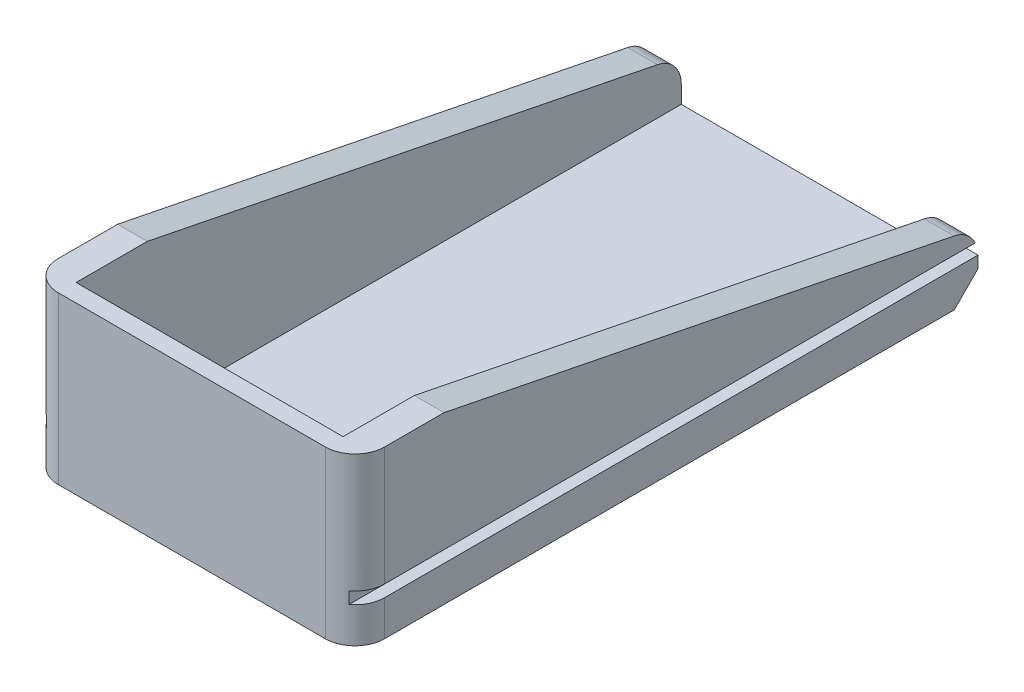
ISO-10303-21;
HEADER;
FILE_DESCRIPTION(('STEP AP214'),'2;1');
FILE_NAME('part.step','',(''),(''),'','','');
FILE_SCHEMA(('AUTOMOTIVE_DESIGN { 1 0 10303 214 1 1 1 1 }'));
ENDSEC;
DATA;
#1=APPLICATION_CONTEXT('core data for automotive mechanical design processes');
#2=APPLICATION_PROTOCOL_DEFINITION('international standard','automotive_design',2000,#1);
#3=PRODUCT_CONTEXT('',#1,'mechanical');
#4=PRODUCT('Part','Part','',(#3));
#5=PRODUCT_RELATED_PRODUCT_CATEGORY('part','',(#4));
#6=PRODUCT_DEFINITION_FORMATION('','',#4);
#7=PRODUCT_DEFINITION_CONTEXT('part definition',#1,'design');
#8=PRODUCT_DEFINITION('design','',#6,#7);
#9=PRODUCT_DEFINITION_SHAPE('','',#8);
#10=(LENGTH_UNIT() NAMED_UNIT(*) SI_UNIT(.MILLI.,.METRE.));
#11=(NAMED_UNIT(*) PLANE_ANGLE_UNIT() SI_UNIT($,.RADIAN.));
#12=(NAMED_UNIT(*) SI_UNIT($,.STERADIAN.) SOLID_ANGLE_UNIT());
#13=UNCERTAINTY_MEASURE_WITH_UNIT(LENGTH_MEASURE(1.E-05),#10,'distance_accuracy_value','');
#14=(GEOMETRIC_REPRESENTATION_CONTEXT(3) GLOBAL_UNCERTAINTY_ASSIGNED_CONTEXT((#13)) GLOBAL_UNIT_ASSIGNED_CONTEXT((#10,
#11,#12)) REPRESENTATION_CONTEXT('',''));
#15=CARTESIAN_POINT('',(0.,0.,0.));
#16=DIRECTION('',(0.,0.,1.));
#17=DIRECTION('',(1.,0.,0.));
#18=AXIS2_PLACEMENT_3D('',#15,#16,#17);
#19=CARTESIAN_POINT('',(-27.5,-3.,52.5));
#20=DIRECTION('',(-1.,0.,0.));
#21=DIRECTION('',(0.,0.,1.));
#22=AXIS2_PLACEMENT_3D('',#19,#20,#21);
#23=PLANE('',#22);
#24=DIRECTION('',(0.,1.,0.));
#25=VECTOR('',#24,1.);
#26=CARTESIAN_POINT('',(-27.5,-3.,-52.5));
#27=LINE('',#26,#25);
#28=CARTESIAN_POINT('',(-27.5,0.999999999999994,-52.5));
#29=VERTEX_POINT('',#28);
#30=CARTESIAN_POINT('',(-27.5,2.90098048640722,-52.5));
#31=VERTEX_POINT('',#30);
#32=EDGE_CURVE('E209',#29,#31,#27,.T.);
#33=ORIENTED_EDGE('',*,*,#32,.F.);
#34=DIRECTION('',(0.,-0.707106781186548,0.707106781186547));
#35=VECTOR('',#34,1.);
#36=CARTESIAN_POINT('',(-27.5,-53.5,1.99999999999993));
#37=LINE('',#36,#35);
#38=CARTESIAN_POINT('',(-27.5,-3.,-48.5));
#39=VERTEX_POINT('',#38);
#40=EDGE_CURVE('E11',#29,#39,#37,.T.);
#41=ORIENTED_EDGE('',*,*,#40,.T.);
#42=DIRECTION('',(0.,0.,1.));
#43=VECTOR('',#42,1.);
#44=CARTESIAN_POINT('',(-27.5,-3.,52.5));
#45=LINE('',#44,#43);
#46=CARTESIAN_POINT('',(-27.5,-3.,47.5));
#47=VERTEX_POINT('',#46);
#48=EDGE_CURVE('E345',#39,#47,#45,.T.);
#49=ORIENTED_EDGE('',*,*,#48,.T.);
#50=DIRECTION('',(0.,1.,0.));
#51=VECTOR('',#50,1.);
#52=CARTESIAN_POINT('',(-27.5,-3.,47.5));
#53=LINE('',#52,#51);
#54=CARTESIAN_POINT('',(-27.5,3.,47.5));
#55=VERTEX_POINT('',#54);
#56=EDGE_CURVE('E283',#47,#55,#53,.T.);
#57=ORIENTED_EDGE('',*,*,#56,.T.);
#58=DIRECTION('',(0.,0.,-1.));
#59=VECTOR('',#58,1.);
#60=CARTESIAN_POINT('',(-27.5,3.,52.5));
#61=LINE('',#60,#59);
#62=CARTESIAN_POINT('',(-27.5,3.,-52.4990194174386));
#63=VERTEX_POINT('',#62);
#64=EDGE_CURVE('E441',#55,#63,#61,.T.);
#65=ORIENTED_EDGE('',*,*,#64,.T.);
#66=CARTESIAN_POINT('',(-27.5,2.90098048640722,-47.5));
#67=DIRECTION('',(-1.,0.,0.));
#68=DIRECTION('',(0.,0.,1.));
#69=AXIS2_PLACEMENT_3D('',#66,#67,#68);
#70=CIRCLE('',#69,5.);
#71=EDGE_CURVE('E216',#63,#31,#70,.T.);
#72=ORIENTED_EDGE('',*,*,#71,.T.);
#73=EDGE_LOOP('',(#33,#41,#49,#57,#65,#72));
#74=FACE_BOUND('',#73,.T.);
#75=ADVANCED_FACE('F42',(#74),#23,.T.);
#76=CARTESIAN_POINT('',(-27.5,-3.,-52.5));
#77=DIRECTION('',(0.,0.,-1.));
#78=DIRECTION('',(-1.,0.,0.));
#79=AXIS2_PLACEMENT_3D('',#76,#77,#78);
#80=PLANE('',#79);
#81=DIRECTION('',(-1.,0.,0.));
#82=VECTOR('',#81,1.);
#83=CARTESIAN_POINT('',(-27.5,-3.,-52.5));
#84=LINE('',#83,#82);
#85=CARTESIAN_POINT('',(23.5,-3.,-52.5));
#86=VERTEX_POINT('',#85);
#87=CARTESIAN_POINT('',(-23.5,-3.,-52.5));
#88=VERTEX_POINT('',#87);
#89=EDGE_CURVE('E213',#86,#88,#84,.T.);
#90=ORIENTED_EDGE('',*,*,#89,.T.);
#91=DIRECTION('',(-0.707106781186548,0.707106781186547,0.));
#92=VECTOR('',#91,1.);
#93=CARTESIAN_POINT('',(-25.5,-1.00000000000001,-52.5));
#94=LINE('',#93,#92);
#95=EDGE_CURVE('E51',#88,#29,#94,.T.);
#96=ORIENTED_EDGE('',*,*,#95,.T.);
#97=ORIENTED_EDGE('',*,*,#32,.T.);
#98=DIRECTION('',(1.,0.,0.));
#99=VECTOR('',#98,1.);
#100=CARTESIAN_POINT('',(-22.5,2.90098048640722,-52.5));
#101=LINE('',#100,#99);
#102=CARTESIAN_POINT('',(-22.5,2.90098048640721,-52.5));
#103=VERTEX_POINT('',#102);
#104=EDGE_CURVE('E236',#31,#103,#101,.T.);
#105=ORIENTED_EDGE('',*,*,#104,.T.);
#106=DIRECTION('',(0.,-1.,0.));
#107=VECTOR('',#106,1.);
#108=CARTESIAN_POINT('',(-22.5,25.,-52.5));
#109=LINE('',#108,#107);
#110=CARTESIAN_POINT('',(-22.5,0.,-52.5));
#111=VERTEX_POINT('',#110);
#112=EDGE_CURVE('E371',#103,#111,#109,.T.);
#113=ORIENTED_EDGE('',*,*,#112,.T.);
#114=DIRECTION('',(-1.,0.,0.));
#115=VECTOR('',#114,1.);
#116=CARTESIAN_POINT('',(-27.5,0.,-52.5));
#117=LINE('',#116,#115);
#118=CARTESIAN_POINT('',(22.5,0.,-52.5));
#119=VERTEX_POINT('',#118);
#120=EDGE_CURVE('E230',#119,#111,#117,.T.);
#121=ORIENTED_EDGE('',*,*,#120,.F.);
#122=DIRECTION('',(0.,-1.,0.));
#123=VECTOR('',#122,1.);
#124=CARTESIAN_POINT('',(22.5,25.,-52.5));
#125=LINE('',#124,#123);
#126=CARTESIAN_POINT('',(22.5,2.90098048640721,-52.5));
#127=VERTEX_POINT('',#126);
#128=EDGE_CURVE('E360',#127,#119,#125,.T.);
#129=ORIENTED_EDGE('',*,*,#128,.F.);
#130=DIRECTION('',(1.,0.,0.));
#131=VECTOR('',#130,1.);
#132=CARTESIAN_POINT('',(27.5,2.90098048640722,-52.5));
#133=LINE('',#132,#131);
#134=CARTESIAN_POINT('',(27.5,2.90098048640722,-52.5));
#135=VERTEX_POINT('',#134);
#136=EDGE_CURVE('E225',#127,#135,#133,.T.);
#137=ORIENTED_EDGE('',*,*,#136,.T.);
#138=DIRECTION('',(0.,1.,0.));
#139=VECTOR('',#138,1.);
#140=CARTESIAN_POINT('',(27.5,-3.,-52.5));
#141=LINE('',#140,#139);
#142=CARTESIAN_POINT('',(27.5,1.,-52.5));
#143=VERTEX_POINT('',#142);
#144=EDGE_CURVE('E220',#143,#135,#141,.T.);
#145=ORIENTED_EDGE('',*,*,#144,.F.);
#146=DIRECTION('',(-0.707106781186548,-0.707106781186547,0.));
#147=VECTOR('',#146,1.);
#148=CARTESIAN_POINT('',(-2.00000000000002,-28.5,-52.5));
#149=LINE('',#148,#147);
#150=EDGE_CURVE('E336',#143,#86,#149,.T.);
#151=ORIENTED_EDGE('',*,*,#150,.T.);
#152=EDGE_LOOP('',(#90,#96,#97,#105,#113,#121,#129,#137,#145,#151));
#153=FACE_BOUND('',#152,.T.);
#154=ADVANCED_FACE('F207',(#153),#80,.T.);
#155=CARTESIAN_POINT('',(0.,-3.,0.));
#156=DIRECTION('',(0.,-1.,0.));
#157=DIRECTION('',(0.,0.,-1.));
#158=AXIS2_PLACEMENT_3D('',#155,#156,#157);
#159=PLANE('',#158);
#160=ORIENTED_EDGE('',*,*,#48,.F.);
#161=DIRECTION('',(0.707106781186548,0.,-0.707106781186547));
#162=VECTOR('',#161,1.);
#163=CARTESIAN_POINT('',(-38.,-3.,-38.0000000000001));
#164=LINE('',#163,#162);
#165=EDGE_CURVE('E58',#39,#88,#164,.T.);
#166=ORIENTED_EDGE('',*,*,#165,.T.);
#167=ORIENTED_EDGE('',*,*,#89,.F.);
#168=DIRECTION('',(0.707106781186548,0.,0.707106781186547));
#169=VECTOR('',#168,1.);
#170=CARTESIAN_POINT('',(38.,-3.,-38.));
#171=LINE('',#170,#169);
#172=CARTESIAN_POINT('',(27.5,-3.,-48.5));
#173=VERTEX_POINT('',#172);
#174=EDGE_CURVE('E339',#86,#173,#171,.T.);
#175=ORIENTED_EDGE('',*,*,#174,.T.);
#176=DIRECTION('',(0.,0.,-1.));
#177=VECTOR('',#176,1.);
#178=CARTESIAN_POINT('',(27.5,-3.,52.5));
#179=LINE('',#178,#177);
#180=CARTESIAN_POINT('',(27.5,-3.,47.5));
#181=VERTEX_POINT('',#180);
#182=EDGE_CURVE('E354',#181,#173,#179,.T.);
#183=ORIENTED_EDGE('',*,*,#182,.F.);
#184=CARTESIAN_POINT('',(22.5,-3.,47.5));
#185=DIRECTION('',(0.,-1.,0.));
#186=DIRECTION('',(0.,0.,-1.));
#187=AXIS2_PLACEMENT_3D('',#184,#185,#186);
#188=CIRCLE('',#187,5.);
#189=CARTESIAN_POINT('',(22.5,-3.,52.5));
#190=VERTEX_POINT('',#189);
#191=EDGE_CURVE('E311',#181,#190,#188,.T.);
#192=ORIENTED_EDGE('',*,*,#191,.T.);
#193=DIRECTION('',(1.,0.,0.));
#194=VECTOR('',#193,1.);
#195=CARTESIAN_POINT('',(-27.5,-3.,52.5));
#196=LINE('',#195,#194);
#197=CARTESIAN_POINT('',(-22.5,-3.,52.5));
#198=VERTEX_POINT('',#197);
#199=EDGE_CURVE('E227',#198,#190,#196,.T.);
#200=ORIENTED_EDGE('',*,*,#199,.F.);
#201=CARTESIAN_POINT('',(-22.5,-3.,47.5));
#202=DIRECTION('',(0.,-1.,0.));
#203=DIRECTION('',(0.,0.,-1.));
#204=AXIS2_PLACEMENT_3D('',#201,#202,#203);
#205=CIRCLE('',#204,5.);
#206=EDGE_CURVE('E315',#198,#47,#205,.T.);
#207=ORIENTED_EDGE('',*,*,#206,.T.);
#208=EDGE_LOOP('',(#160,#166,#167,#175,#183,#192,#200,#207));
#209=FACE_BOUND('',#208,.T.);
#210=ADVANCED_FACE('F344',(#209),#159,.T.);
#211=CARTESIAN_POINT('',(27.5,-3.,52.5));
#212=DIRECTION('',(1.,0.,0.));
#213=DIRECTION('',(0.,0.,-1.));
#214=AXIS2_PLACEMENT_3D('',#211,#212,#213);
#215=PLANE('',#214);
#216=ORIENTED_EDGE('',*,*,#182,.T.);
#217=DIRECTION('',(0.,0.707106781186548,-0.707106781186547));
#218=VECTOR('',#217,1.);
#219=CARTESIAN_POINT('',(27.5,-53.5,1.99999999999993));
#220=LINE('',#219,#218);
#221=EDGE_CURVE('E65',#173,#143,#220,.T.);
#222=ORIENTED_EDGE('',*,*,#221,.T.);
#223=ORIENTED_EDGE('',*,*,#144,.T.);
#224=CARTESIAN_POINT('',(27.5,2.90098048640722,-47.5));
#225=DIRECTION('',(1.,0.,0.));
#226=DIRECTION('',(0.,0.,-1.));
#227=AXIS2_PLACEMENT_3D('',#224,#225,#226);
#228=CIRCLE('',#227,5.);
#229=CARTESIAN_POINT('',(27.5,3.,-52.4990194174386));
#230=VERTEX_POINT('',#229);
#231=EDGE_CURVE('E250',#135,#230,#228,.T.);
#232=ORIENTED_EDGE('',*,*,#231,.T.);
#233=DIRECTION('',(0.,0.,-1.));
#234=VECTOR('',#233,1.);
#235=CARTESIAN_POINT('',(27.5,3.,52.5));
#236=LINE('',#235,#234);
#237=CARTESIAN_POINT('',(27.5,3.,47.5));
#238=VERTEX_POINT('',#237);
#239=EDGE_CURVE('E432',#238,#230,#236,.T.);
#240=ORIENTED_EDGE('',*,*,#239,.F.);
#241=DIRECTION('',(0.,1.,0.));
#242=VECTOR('',#241,1.);
#243=CARTESIAN_POINT('',(27.5,-3.,47.5));
#244=LINE('',#243,#242);
#245=EDGE_CURVE('E325',#238,#181,#244,.F.);
#246=ORIENTED_EDGE('',*,*,#245,.T.);
#247=EDGE_LOOP('',(#216,#222,#223,#232,#240,#246));
#248=FACE_BOUND('',#247,.T.);
#249=ADVANCED_FACE('F561',(#248),#215,.T.);
#250=CARTESIAN_POINT('',(-27.5,-3.,52.5));
#251=DIRECTION('',(0.,0.,1.));
#252=DIRECTION('',(1.,0.,0.));
#253=AXIS2_PLACEMENT_3D('',#250,#251,#252);
#254=PLANE('',#253);
#255=DIRECTION('',(1.,0.,0.));
#256=VECTOR('',#255,1.);
#257=CARTESIAN_POINT('',(-27.5,25.,52.5));
#258=LINE('',#257,#256);
#259=CARTESIAN_POINT('',(-22.5,25.,52.5));
#260=VERTEX_POINT('',#259);
#261=CARTESIAN_POINT('',(22.5,25.,52.5));
#262=VERTEX_POINT('',#261);
#263=EDGE_CURVE('E401',#260,#262,#258,.T.);
#264=ORIENTED_EDGE('',*,*,#263,.F.);
#265=DIRECTION('',(0.,1.,0.));
#266=VECTOR('',#265,1.);
#267=CARTESIAN_POINT('',(-22.5,-3.,52.5));
#268=LINE('',#267,#266);
#269=EDGE_CURVE('E308',#260,#198,#268,.F.);
#270=ORIENTED_EDGE('',*,*,#269,.T.);
#271=ORIENTED_EDGE('',*,*,#199,.T.);
#272=DIRECTION('',(0.,1.,0.));
#273=VECTOR('',#272,1.);
#274=CARTESIAN_POINT('',(22.5,-3.,52.5));
#275=LINE('',#274,#273);
#276=EDGE_CURVE('E305',#190,#262,#275,.T.);
#277=ORIENTED_EDGE('',*,*,#276,.T.);
#278=EDGE_LOOP('',(#264,#270,#271,#277));
#279=FACE_BOUND('',#278,.T.);
#280=ADVANCED_FACE('F487',(#279),#254,.T.);
#281=DIRECTION('',(0.,0.,1.));
#282=VECTOR('',#281,1.);
#283=CARTESIAN_POINT('',(-27.5,5.,52.5));
#284=LINE('',#283,#282);
#285=CARTESIAN_POINT('',(-27.5,5.,-52.0380741599887));
#286=VERTEX_POINT('',#285);
#287=CARTESIAN_POINT('',(-27.5,5.,47.5));
#288=VERTEX_POINT('',#287);
#289=EDGE_CURVE('E445',#286,#288,#284,.T.);
#290=ORIENTED_EDGE('',*,*,#289,.T.);
#291=DIRECTION('',(0.,1.,0.));
#292=VECTOR('',#291,1.);
#293=CARTESIAN_POINT('',(-27.5,15.,47.5));
#294=LINE('',#293,#292);
#295=CARTESIAN_POINT('',(-27.5,25.,47.5));
#296=VERTEX_POINT('',#295);
#297=EDGE_CURVE('E296',#288,#296,#294,.T.);
#298=ORIENTED_EDGE('',*,*,#297,.T.);
#299=DIRECTION('',(0.,0.,1.));
#300=VECTOR('',#299,1.);
#301=CARTESIAN_POINT('',(-27.5,25.,52.5));
#302=LINE('',#301,#300);
#303=CARTESIAN_POINT('',(-27.4999999999999,25.,37.5));
#304=VERTEX_POINT('',#303);
#305=EDGE_CURVE('E379',#304,#296,#302,.T.);
#306=ORIENTED_EDGE('',*,*,#305,.F.);
#307=DIRECTION('',(0.,-0.196116135138184,-0.98058067569092));
#308=VECTOR('',#307,1.);
#309=CARTESIAN_POINT('',(-27.5,7.,-52.5));
#310=LINE('',#309,#308);
#311=CARTESIAN_POINT('',(-27.5,7.80388386486182,-48.4805806756909));
#312=VERTEX_POINT('',#311);
#313=EDGE_CURVE('E418',#304,#312,#310,.T.);
#314=ORIENTED_EDGE('',*,*,#313,.T.);
#315=EDGE_CURVE('E245',#312,#286,#70,.T.);
#316=ORIENTED_EDGE('',*,*,#315,.T.);
#317=EDGE_LOOP('',(#290,#298,#306,#314,#316));
#318=FACE_BOUND('',#317,.T.);
#319=ADVANCED_FACE('F467',(#318),#23,.T.);
#320=CARTESIAN_POINT('',(-27.5,2.90098048640722,-47.5));
#321=DIRECTION('',(-1.,0.,0.));
#322=DIRECTION('',(0.,0.,1.));
#323=AXIS2_PLACEMENT_3D('',#320,#321,#322);
#324=CYLINDRICAL_SURFACE('',#323,5.);
#325=ORIENTED_EDGE('',*,*,#71,.F.);
#326=DIRECTION('',(-1.,0.,0.));
#327=VECTOR('',#326,1.);
#328=CARTESIAN_POINT('',(-27.5,3.,-52.4990194174386));
#329=LINE('',#328,#327);
#330=CARTESIAN_POINT('',(-25.5,3.,-52.4990194174386));
#331=VERTEX_POINT('',#330);
#332=EDGE_CURVE('E279',#63,#331,#329,.F.);
#333=ORIENTED_EDGE('',*,*,#332,.T.);
#334=CARTESIAN_POINT('',(-25.5,2.90098048640722,-47.5));
#335=DIRECTION('',(-1.,0.,0.));
#336=DIRECTION('',(0.,0.,1.));
#337=AXIS2_PLACEMENT_3D('',#334,#335,#336);
#338=CIRCLE('',#337,5.);
#339=CARTESIAN_POINT('',(-25.5,5.,-52.0380741599887));
#340=VERTEX_POINT('',#339);
#341=EDGE_CURVE('E271',#331,#340,#338,.F.);
#342=ORIENTED_EDGE('',*,*,#341,.T.);
#343=DIRECTION('',(-1.,0.,0.));
#344=VECTOR('',#343,1.);
#345=CARTESIAN_POINT('',(-27.5,5.,-52.0380741599887));
#346=LINE('',#345,#344);
#347=EDGE_CURVE('E275',#340,#286,#346,.T.);
#348=ORIENTED_EDGE('',*,*,#347,.T.);
#349=ORIENTED_EDGE('',*,*,#315,.F.);
#350=DIRECTION('',(1.,0.,0.));
#351=VECTOR('',#350,1.);
#352=CARTESIAN_POINT('',(-27.5,7.80388386486181,-48.4805806756909));
#353=LINE('',#352,#351);
#354=CARTESIAN_POINT('',(-22.5,7.80388386486181,-48.4805806756909));
#355=VERTEX_POINT('',#354);
#356=EDGE_CURVE('E242',#355,#312,#353,.F.);
#357=ORIENTED_EDGE('',*,*,#356,.F.);
#358=CARTESIAN_POINT('',(-22.5,2.90098048640722,-47.5));
#359=DIRECTION('',(-1.,0.,0.));
#360=DIRECTION('',(0.,0.,1.));
#361=AXIS2_PLACEMENT_3D('',#358,#359,#360);
#362=CIRCLE('',#361,5.);
#363=EDGE_CURVE('E239',#103,#355,#362,.F.);
#364=ORIENTED_EDGE('',*,*,#363,.F.);
#365=ORIENTED_EDGE('',*,*,#104,.F.);
#366=EDGE_LOOP('',(#325,#333,#342,#348,#349,#357,#364,#365));
#367=FACE_BOUND('',#366,.T.);
#368=ADVANCED_FACE('F479',(#367),#324,.T.);
#369=DIRECTION('',(0.,0.,-1.));
#370=VECTOR('',#369,1.);
#371=CARTESIAN_POINT('',(27.5,25.,52.5));
#372=LINE('',#371,#370);
#373=CARTESIAN_POINT('',(27.5,25.,47.5));
#374=VERTEX_POINT('',#373);
#375=CARTESIAN_POINT('',(27.5,25.,37.5));
#376=VERTEX_POINT('',#375);
#377=EDGE_CURVE('E398',#374,#376,#372,.T.);
#378=ORIENTED_EDGE('',*,*,#377,.F.);
#379=DIRECTION('',(0.,1.,0.));
#380=VECTOR('',#379,1.);
#381=CARTESIAN_POINT('',(27.5,-3.,47.5));
#382=LINE('',#381,#380);
#383=CARTESIAN_POINT('',(27.5,5.,47.5));
#384=VERTEX_POINT('',#383);
#385=EDGE_CURVE('E328',#374,#384,#382,.F.);
#386=ORIENTED_EDGE('',*,*,#385,.T.);
#387=DIRECTION('',(0.,0.,1.));
#388=VECTOR('',#387,1.);
#389=CARTESIAN_POINT('',(27.5,5.,52.5));
#390=LINE('',#389,#388);
#391=CARTESIAN_POINT('',(27.5,5.,-52.0380741599887));
#392=VERTEX_POINT('',#391);
#393=EDGE_CURVE('E427',#392,#384,#390,.T.);
#394=ORIENTED_EDGE('',*,*,#393,.F.);
#395=CARTESIAN_POINT('',(27.5,7.80388386486182,-48.4805806756909));
#396=VERTEX_POINT('',#395);
#397=EDGE_CURVE('E249',#392,#396,#228,.T.);
#398=ORIENTED_EDGE('',*,*,#397,.T.);
#399=DIRECTION('',(0.,-0.196116135138184,-0.98058067569092));
#400=VECTOR('',#399,1.);
#401=CARTESIAN_POINT('',(27.5,7.,-52.5));
#402=LINE('',#401,#400);
#403=EDGE_CURVE('E419',#376,#396,#402,.T.);
#404=ORIENTED_EDGE('',*,*,#403,.F.);
#405=EDGE_LOOP('',(#378,#386,#394,#398,#404));
#406=FACE_BOUND('',#405,.T.);
#407=ADVANCED_FACE('F499',(#406),#215,.T.);
#408=CARTESIAN_POINT('',(0.,0.,0.));
#409=DIRECTION('',(0.,-1.,0.));
#410=DIRECTION('',(0.,0.,-1.));
#411=AXIS2_PLACEMENT_3D('',#408,#409,#410);
#412=PLANE('',#411);
#413=DIRECTION('',(0.,0.,-1.));
#414=VECTOR('',#413,1.);
#415=CARTESIAN_POINT('',(-22.5,0.,-52.5));
#416=LINE('',#415,#414);
#417=CARTESIAN_POINT('',(-22.5,0.,49.5));
#418=VERTEX_POINT('',#417);
#419=EDGE_CURVE('E375',#418,#111,#416,.T.);
#420=ORIENTED_EDGE('',*,*,#419,.F.);
#421=DIRECTION('',(-1.,0.,0.));
#422=VECTOR('',#421,1.);
#423=CARTESIAN_POINT('',(-22.5,0.,49.5));
#424=LINE('',#423,#422);
#425=CARTESIAN_POINT('',(22.5,0.,49.5));
#426=VERTEX_POINT('',#425);
#427=EDGE_CURVE('E380',#426,#418,#424,.T.);
#428=ORIENTED_EDGE('',*,*,#427,.F.);
#429=DIRECTION('',(0.,0.,1.));
#430=VECTOR('',#429,1.);
#431=CARTESIAN_POINT('',(22.5,0.,-52.5));
#432=LINE('',#431,#430);
#433=EDGE_CURVE('E384',#119,#426,#432,.T.);
#434=ORIENTED_EDGE('',*,*,#433,.F.);
#435=ORIENTED_EDGE('',*,*,#120,.T.);
#436=EDGE_LOOP('',(#420,#428,#434,#435));
#437=FACE_BOUND('',#436,.T.);
#438=ADVANCED_FACE('F532',(#437),#412,.F.);
#439=CARTESIAN_POINT('',(22.5,25.,-52.5));
#440=DIRECTION('',(1.,0.,0.));
#441=DIRECTION('',(0.,0.,-1.));
#442=AXIS2_PLACEMENT_3D('',#439,#440,#441);
#443=PLANE('',#442);
#444=DIRECTION('',(0.,-0.196116135138184,-0.98058067569092));
#445=VECTOR('',#444,1.);
#446=CARTESIAN_POINT('',(22.5,7.69230769230769,-49.0384615384615));
#447=LINE('',#446,#445);
#448=CARTESIAN_POINT('',(22.5,25.,37.5));
#449=VERTEX_POINT('',#448);
#450=CARTESIAN_POINT('',(22.5,7.80388386486181,-48.4805806756909));
#451=VERTEX_POINT('',#450);
#452=EDGE_CURVE('E388',#449,#451,#447,.T.);
#453=ORIENTED_EDGE('',*,*,#452,.T.);
#454=CARTESIAN_POINT('',(22.5,2.90098048640722,-47.5));
#455=DIRECTION('',(1.,0.,0.));
#456=DIRECTION('',(0.,0.,-1.));
#457=AXIS2_PLACEMENT_3D('',#454,#455,#456);
#458=CIRCLE('',#457,5.);
#459=EDGE_CURVE('E257',#451,#127,#458,.F.);
#460=ORIENTED_EDGE('',*,*,#459,.T.);
#461=ORIENTED_EDGE('',*,*,#128,.T.);
#462=ORIENTED_EDGE('',*,*,#433,.T.);
#463=DIRECTION('',(0.,-1.,0.));
#464=VECTOR('',#463,1.);
#465=CARTESIAN_POINT('',(22.5,25.,49.5));
#466=LINE('',#465,#464);
#467=CARTESIAN_POINT('',(22.5,25.,49.5));
#468=VERTEX_POINT('',#467);
#469=EDGE_CURVE('E363',#468,#426,#466,.T.);
#470=ORIENTED_EDGE('',*,*,#469,.F.);
#471=DIRECTION('',(0.,0.,1.));
#472=VECTOR('',#471,1.);
#473=CARTESIAN_POINT('',(22.5,25.,-52.5));
#474=LINE('',#473,#472);
#475=EDGE_CURVE('E395',#449,#468,#474,.T.);
#476=ORIENTED_EDGE('',*,*,#475,.F.);
#477=EDGE_LOOP('',(#453,#460,#461,#462,#470,#476));
#478=FACE_BOUND('',#477,.T.);
#479=ADVANCED_FACE('F523',(#478),#443,.F.);
#480=CARTESIAN_POINT('',(-22.5,25.,49.5));
#481=DIRECTION('',(0.,0.,1.));
#482=DIRECTION('',(1.,0.,0.));
#483=AXIS2_PLACEMENT_3D('',#480,#481,#482);
#484=PLANE('',#483);
#485=ORIENTED_EDGE('',*,*,#427,.T.);
#486=DIRECTION('',(0.,-1.,0.));
#487=VECTOR('',#486,1.);
#488=CARTESIAN_POINT('',(-22.5,25.,49.5));
#489=LINE('',#488,#487);
#490=CARTESIAN_POINT('',(-22.5,25.,49.5));
#491=VERTEX_POINT('',#490);
#492=EDGE_CURVE('E367',#491,#418,#489,.T.);
#493=ORIENTED_EDGE('',*,*,#492,.F.);
#494=DIRECTION('',(-1.,0.,0.));
#495=VECTOR('',#494,1.);
#496=CARTESIAN_POINT('',(-22.5,25.,49.5));
#497=LINE('',#496,#495);
#498=EDGE_CURVE('E392',#468,#491,#497,.T.);
#499=ORIENTED_EDGE('',*,*,#498,.F.);
#500=ORIENTED_EDGE('',*,*,#469,.T.);
#501=EDGE_LOOP('',(#485,#493,#499,#500));
#502=FACE_BOUND('',#501,.T.);
#503=ADVANCED_FACE('F538',(#502),#484,.F.);
#504=CARTESIAN_POINT('',(-22.5,25.,-52.5));
#505=DIRECTION('',(-1.,0.,0.));
#506=DIRECTION('',(0.,0.,1.));
#507=AXIS2_PLACEMENT_3D('',#504,#505,#506);
#508=PLANE('',#507);
#509=ORIENTED_EDGE('',*,*,#112,.F.);
#510=ORIENTED_EDGE('',*,*,#363,.T.);
#511=DIRECTION('',(0.,0.196116135138184,0.98058067569092));
#512=VECTOR('',#511,1.);
#513=CARTESIAN_POINT('',(-22.5,7.69230769230769,-49.0384615384615));
#514=LINE('',#513,#512);
#515=CARTESIAN_POINT('',(-22.5,25.,37.5));
#516=VERTEX_POINT('',#515);
#517=EDGE_CURVE('E411',#355,#516,#514,.T.);
#518=ORIENTED_EDGE('',*,*,#517,.T.);
#519=DIRECTION('',(0.,0.,-1.));
#520=VECTOR('',#519,1.);
#521=CARTESIAN_POINT('',(-22.5,25.,-52.5));
#522=LINE('',#521,#520);
#523=EDGE_CURVE('E374',#491,#516,#522,.T.);
#524=ORIENTED_EDGE('',*,*,#523,.F.);
#525=ORIENTED_EDGE('',*,*,#492,.T.);
#526=ORIENTED_EDGE('',*,*,#419,.T.);
#527=EDGE_LOOP('',(#509,#510,#518,#524,#525,#526));
#528=FACE_BOUND('',#527,.T.);
#529=ADVANCED_FACE('F534',(#528),#508,.F.);
#530=CARTESIAN_POINT('',(0.,25.,0.));
#531=DIRECTION('',(0.,-1.,0.));
#532=DIRECTION('',(0.,0.,-1.));
#533=AXIS2_PLACEMENT_3D('',#530,#531,#532);
#534=PLANE('',#533);
#535=ORIENTED_EDGE('',*,*,#305,.T.);
#536=CARTESIAN_POINT('',(-22.5,25.,47.5));
#537=DIRECTION('',(0.,-1.,0.));
#538=DIRECTION('',(0.,0.,-1.));
#539=AXIS2_PLACEMENT_3D('',#536,#537,#538);
#540=CIRCLE('',#539,5.);
#541=EDGE_CURVE('E302',#296,#260,#540,.F.);
#542=ORIENTED_EDGE('',*,*,#541,.T.);
#543=ORIENTED_EDGE('',*,*,#263,.T.);
#544=CARTESIAN_POINT('',(22.5,25.,47.5));
#545=DIRECTION('',(0.,-1.,0.));
#546=DIRECTION('',(0.,0.,-1.));
#547=AXIS2_PLACEMENT_3D('',#544,#545,#546);
#548=CIRCLE('',#547,5.);
#549=EDGE_CURVE('E299',#262,#374,#548,.F.);
#550=ORIENTED_EDGE('',*,*,#549,.T.);
#551=ORIENTED_EDGE('',*,*,#377,.T.);
#552=DIRECTION('',(-1.,0.,0.));
#553=VECTOR('',#552,1.);
#554=CARTESIAN_POINT('',(0.,25.,37.5));
#555=LINE('',#554,#553);
#556=EDGE_CURVE('E219',#376,#449,#555,.T.);
#557=ORIENTED_EDGE('',*,*,#556,.T.);
#558=ORIENTED_EDGE('',*,*,#475,.T.);
#559=ORIENTED_EDGE('',*,*,#498,.T.);
#560=ORIENTED_EDGE('',*,*,#523,.T.);
#561=DIRECTION('',(1.,0.,0.));
#562=VECTOR('',#561,1.);
#563=CARTESIAN_POINT('',(-27.5,25.,37.5));
#564=LINE('',#563,#562);
#565=EDGE_CURVE('E414',#304,#516,#564,.T.);
#566=ORIENTED_EDGE('',*,*,#565,.F.);
#567=EDGE_LOOP('',(#535,#542,#543,#550,#551,#557,#558,#559,#560,#566));
#568=FACE_BOUND('',#567,.T.);
#569=ADVANCED_FACE('F470',(#568),#534,.F.);
#570=CARTESIAN_POINT('',(-27.5,7.,-52.5));
#571=DIRECTION('',(0.,-0.98058067569092,0.196116135138184));
#572=DIRECTION('',(0.,-0.196116135138184,-0.98058067569092));
#573=AXIS2_PLACEMENT_3D('',#570,#571,#572);
#574=PLANE('',#573);
#575=ORIENTED_EDGE('',*,*,#517,.F.);
#576=ORIENTED_EDGE('',*,*,#356,.T.);
#577=ORIENTED_EDGE('',*,*,#313,.F.);
#578=ORIENTED_EDGE('',*,*,#565,.T.);
#579=EDGE_LOOP('',(#575,#576,#577,#578));
#580=FACE_BOUND('',#579,.T.);
#581=ADVANCED_FACE('F475',(#580),#574,.F.);
#582=ORIENTED_EDGE('',*,*,#403,.T.);
#583=DIRECTION('',(1.,0.,0.));
#584=VECTOR('',#583,1.);
#585=CARTESIAN_POINT('',(22.5,7.80388386486181,-48.4805806756909));
#586=LINE('',#585,#584);
#587=EDGE_CURVE('E254',#396,#451,#586,.F.);
#588=ORIENTED_EDGE('',*,*,#587,.T.);
#589=ORIENTED_EDGE('',*,*,#452,.F.);
#590=ORIENTED_EDGE('',*,*,#556,.F.);
#591=EDGE_LOOP('',(#582,#588,#589,#590));
#592=FACE_BOUND('',#591,.T.);
#593=ADVANCED_FACE('F518',(#592),#574,.F.);
#594=CARTESIAN_POINT('',(-27.5,2.90098048640722,-47.5));
#595=DIRECTION('',(-1.,0.,0.));
#596=DIRECTION('',(0.,0.,1.));
#597=AXIS2_PLACEMENT_3D('',#594,#595,#596);
#598=CYLINDRICAL_SURFACE('',#597,5.);
#599=DIRECTION('',(-1.,0.,0.));
#600=VECTOR('',#599,1.);
#601=CARTESIAN_POINT('',(-27.5,5.,-52.0380741599887));
#602=LINE('',#601,#600);
#603=CARTESIAN_POINT('',(25.5,5.,-52.0380741599887));
#604=VERTEX_POINT('',#603);
#605=EDGE_CURVE('E268',#604,#392,#602,.F.);
#606=ORIENTED_EDGE('',*,*,#605,.F.);
#607=CARTESIAN_POINT('',(25.5,2.90098048640722,-47.5));
#608=DIRECTION('',(1.,0.,0.));
#609=DIRECTION('',(0.,0.,-1.));
#610=AXIS2_PLACEMENT_3D('',#607,#608,#609);
#611=CIRCLE('',#610,5.);
#612=CARTESIAN_POINT('',(25.5,3.,-52.4990194174386));
#613=VERTEX_POINT('',#612);
#614=EDGE_CURVE('E260',#604,#613,#611,.F.);
#615=ORIENTED_EDGE('',*,*,#614,.T.);
#616=DIRECTION('',(-1.,0.,0.));
#617=VECTOR('',#616,1.);
#618=CARTESIAN_POINT('',(-27.5,3.,-52.4990194174386));
#619=LINE('',#618,#617);
#620=EDGE_CURVE('E264',#230,#613,#619,.T.);
#621=ORIENTED_EDGE('',*,*,#620,.F.);
#622=ORIENTED_EDGE('',*,*,#231,.F.);
#623=ORIENTED_EDGE('',*,*,#136,.F.);
#624=ORIENTED_EDGE('',*,*,#459,.F.);
#625=ORIENTED_EDGE('',*,*,#587,.F.);
#626=ORIENTED_EDGE('',*,*,#397,.F.);
#627=EDGE_LOOP('',(#606,#615,#621,#622,#623,#624,#625,#626));
#628=FACE_BOUND('',#627,.T.);
#629=ADVANCED_FACE('F512',(#628),#598,.T.);
#630=CARTESIAN_POINT('',(25.5,5.,52.5));
#631=DIRECTION('',(0.,1.,0.));
#632=DIRECTION('',(0.,0.,1.));
#633=AXIS2_PLACEMENT_3D('',#630,#631,#632);
#634=PLANE('',#633);
#635=ORIENTED_EDGE('',*,*,#393,.T.);
#636=CARTESIAN_POINT('',(22.5,5.,47.5));
#637=DIRECTION('',(0.,1.,0.));
#638=DIRECTION('',(0.,0.,1.));
#639=AXIS2_PLACEMENT_3D('',#636,#637,#638);
#640=CIRCLE('',#639,5.);
#641=CARTESIAN_POINT('',(25.5,5.,51.5));
#642=VERTEX_POINT('',#641);
#643=EDGE_CURVE('E331',#384,#642,#640,.F.);
#644=ORIENTED_EDGE('',*,*,#643,.T.);
#645=DIRECTION('',(0.,0.,1.));
#646=VECTOR('',#645,1.);
#647=CARTESIAN_POINT('',(25.5,5.,52.5));
#648=LINE('',#647,#646);
#649=EDGE_CURVE('E423',#604,#642,#648,.T.);
#650=ORIENTED_EDGE('',*,*,#649,.F.);
#651=ORIENTED_EDGE('',*,*,#605,.T.);
#652=EDGE_LOOP('',(#635,#644,#650,#651));
#653=FACE_BOUND('',#652,.T.);
#654=ADVANCED_FACE('F505',(#653),#634,.F.);
#655=CARTESIAN_POINT('',(25.5,3.,52.5));
#656=DIRECTION('',(0.,-1.,0.));
#657=DIRECTION('',(0.,0.,-1.));
#658=AXIS2_PLACEMENT_3D('',#655,#656,#657);
#659=PLANE('',#658);
#660=DIRECTION('',(0.,0.,-1.));
#661=VECTOR('',#660,1.);
#662=CARTESIAN_POINT('',(25.5,3.,52.5));
#663=LINE('',#662,#661);
#664=CARTESIAN_POINT('',(25.5,3.,51.5));
#665=VERTEX_POINT('',#664);
#666=EDGE_CURVE('E431',#665,#613,#663,.T.);
#667=ORIENTED_EDGE('',*,*,#666,.F.);
#668=CARTESIAN_POINT('',(22.5,3.,47.5));
#669=DIRECTION('',(0.,-1.,0.));
#670=DIRECTION('',(0.,0.,-1.));
#671=AXIS2_PLACEMENT_3D('',#668,#669,#670);
#672=CIRCLE('',#671,5.);
#673=EDGE_CURVE('E322',#665,#238,#672,.F.);
#674=ORIENTED_EDGE('',*,*,#673,.T.);
#675=ORIENTED_EDGE('',*,*,#239,.T.);
#676=ORIENTED_EDGE('',*,*,#620,.T.);
#677=EDGE_LOOP('',(#667,#674,#675,#676));
#678=FACE_BOUND('',#677,.T.);
#679=ADVANCED_FACE('F667',(#678),#659,.F.);
#680=CARTESIAN_POINT('',(25.5,0.,0.));
#681=DIRECTION('',(1.,0.,0.));
#682=DIRECTION('',(0.,0.,-1.));
#683=AXIS2_PLACEMENT_3D('',#680,#681,#682);
#684=PLANE('',#683);
#685=DIRECTION('',(0.,1.,0.));
#686=VECTOR('',#685,1.);
#687=CARTESIAN_POINT('',(25.5,5.,51.5));
#688=LINE('',#687,#686);
#689=EDGE_CURVE('E319',#642,#665,#688,.F.);
#690=ORIENTED_EDGE('',*,*,#689,.T.);
#691=ORIENTED_EDGE('',*,*,#666,.T.);
#692=ORIENTED_EDGE('',*,*,#614,.F.);
#693=ORIENTED_EDGE('',*,*,#649,.T.);
#694=EDGE_LOOP('',(#690,#691,#692,#693));
#695=FACE_BOUND('',#694,.T.);
#696=ADVANCED_FACE('F508',(#695),#684,.T.);
#697=CARTESIAN_POINT('',(-25.5,3.,52.5));
#698=DIRECTION('',(0.,1.,0.));
#699=DIRECTION('',(0.,0.,1.));
#700=AXIS2_PLACEMENT_3D('',#697,#698,#699);
#701=PLANE('',#700);
#702=ORIENTED_EDGE('',*,*,#64,.F.);
#703=CARTESIAN_POINT('',(-22.5,3.,47.5));
#704=DIRECTION('',(0.,1.,0.));
#705=DIRECTION('',(0.,0.,1.));
#706=AXIS2_PLACEMENT_3D('',#703,#704,#705);
#707=CIRCLE('',#706,5.);
#708=CARTESIAN_POINT('',(-25.5,3.,51.5));
#709=VERTEX_POINT('',#708);
#710=EDGE_CURVE('E287',#55,#709,#707,.T.);
#711=ORIENTED_EDGE('',*,*,#710,.T.);
#712=DIRECTION('',(0.,0.,-1.));
#713=VECTOR('',#712,1.);
#714=CARTESIAN_POINT('',(-25.5,3.,52.5));
#715=LINE('',#714,#713);
#716=EDGE_CURVE('E435',#709,#331,#715,.T.);
#717=ORIENTED_EDGE('',*,*,#716,.T.);
#718=ORIENTED_EDGE('',*,*,#332,.F.);
#719=EDGE_LOOP('',(#702,#711,#717,#718));
#720=FACE_BOUND('',#719,.T.);
#721=ADVANCED_FACE('F485',(#720),#701,.T.);
#722=CARTESIAN_POINT('',(-25.5,5.,52.5));
#723=DIRECTION('',(0.,-1.,0.));
#724=DIRECTION('',(0.,0.,-1.));
#725=AXIS2_PLACEMENT_3D('',#722,#723,#724);
#726=PLANE('',#725);
#727=DIRECTION('',(0.,0.,1.));
#728=VECTOR('',#727,1.);
#729=CARTESIAN_POINT('',(-25.5,5.,52.5));
#730=LINE('',#729,#728);
#731=CARTESIAN_POINT('',(-25.5,5.,51.5));
#732=VERTEX_POINT('',#731);
#733=EDGE_CURVE('E444',#340,#732,#730,.T.);
#734=ORIENTED_EDGE('',*,*,#733,.T.);
#735=CARTESIAN_POINT('',(-22.5,5.,47.5));
#736=DIRECTION('',(0.,-1.,0.));
#737=DIRECTION('',(0.,0.,-1.));
#738=AXIS2_PLACEMENT_3D('',#735,#736,#737);
#739=CIRCLE('',#738,5.);
#740=EDGE_CURVE('E293',#732,#288,#739,.T.);
#741=ORIENTED_EDGE('',*,*,#740,.T.);
#742=ORIENTED_EDGE('',*,*,#289,.F.);
#743=ORIENTED_EDGE('',*,*,#347,.F.);
#744=EDGE_LOOP('',(#734,#741,#742,#743));
#745=FACE_BOUND('',#744,.T.);
#746=ADVANCED_FACE('F456',(#745),#726,.T.);
#747=CARTESIAN_POINT('',(-25.5,0.,0.));
#748=DIRECTION('',(-1.,0.,0.));
#749=DIRECTION('',(0.,0.,-1.));
#750=AXIS2_PLACEMENT_3D('',#747,#748,#749);
#751=PLANE('',#750);
#752=ORIENTED_EDGE('',*,*,#716,.F.);
#753=DIRECTION('',(0.,1.,0.));
#754=VECTOR('',#753,1.);
#755=CARTESIAN_POINT('',(-25.5,3.,51.5));
#756=LINE('',#755,#754);
#757=EDGE_CURVE('E290',#709,#732,#756,.T.);
#758=ORIENTED_EDGE('',*,*,#757,.T.);
#759=ORIENTED_EDGE('',*,*,#733,.F.);
#760=ORIENTED_EDGE('',*,*,#341,.F.);
#761=EDGE_LOOP('',(#752,#758,#759,#760));
#762=FACE_BOUND('',#761,.T.);
#763=ADVANCED_FACE('F482',(#762),#751,.T.);
#764=CARTESIAN_POINT('',(-22.5,-3.,47.5));
#765=DIRECTION('',(0.,1.,0.));
#766=DIRECTION('',(0.,0.,1.));
#767=AXIS2_PLACEMENT_3D('',#764,#765,#766);
#768=CYLINDRICAL_SURFACE('',#767,5.);
#769=ORIENTED_EDGE('',*,*,#206,.F.);
#770=ORIENTED_EDGE('',*,*,#269,.F.);
#771=ORIENTED_EDGE('',*,*,#541,.F.);
#772=ORIENTED_EDGE('',*,*,#297,.F.);
#773=ORIENTED_EDGE('',*,*,#740,.F.);
#774=ORIENTED_EDGE('',*,*,#757,.F.);
#775=ORIENTED_EDGE('',*,*,#710,.F.);
#776=ORIENTED_EDGE('',*,*,#56,.F.);
#777=EDGE_LOOP('',(#769,#770,#771,#772,#773,#774,#775,#776));
#778=FACE_BOUND('',#777,.T.);
#779=ADVANCED_FACE('F462',(#778),#768,.T.);
#780=CARTESIAN_POINT('',(22.5,-3.,47.5));
#781=DIRECTION('',(0.,1.,0.));
#782=DIRECTION('',(0.,0.,1.));
#783=AXIS2_PLACEMENT_3D('',#780,#781,#782);
#784=CYLINDRICAL_SURFACE('',#783,5.);
#785=ORIENTED_EDGE('',*,*,#549,.F.);
#786=ORIENTED_EDGE('',*,*,#276,.F.);
#787=ORIENTED_EDGE('',*,*,#191,.F.);
#788=ORIENTED_EDGE('',*,*,#245,.F.);
#789=ORIENTED_EDGE('',*,*,#673,.F.);
#790=ORIENTED_EDGE('',*,*,#689,.F.);
#791=ORIENTED_EDGE('',*,*,#643,.F.);
#792=ORIENTED_EDGE('',*,*,#385,.F.);
#793=EDGE_LOOP('',(#785,#786,#787,#788,#789,#790,#791,#792));
#794=FACE_BOUND('',#793,.T.);
#795=ADVANCED_FACE('F44',(#794),#784,.T.);
#796=CARTESIAN_POINT('',(26.3333333333333,-26.3333333333333,-26.3333333333334));
#797=DIRECTION('',(0.577350269189625,-0.577350269189626,-0.577350269189626));
#798=DIRECTION('',(0.,0.707106781186548,-0.707106781186547));
#799=AXIS2_PLACEMENT_3D('',#796,#797,#798);
#800=PLANE('',#799);
#801=ORIENTED_EDGE('',*,*,#221,.F.);
#802=ORIENTED_EDGE('',*,*,#174,.F.);
#803=ORIENTED_EDGE('',*,*,#150,.F.);
#804=EDGE_LOOP('',(#801,#802,#803));
#805=FACE_BOUND('',#804,.T.);
#806=ADVANCED_FACE('F733',(#805),#800,.T.);
#807=CARTESIAN_POINT('',(-26.3333333333333,-26.3333333333333,-26.3333333333334));
#808=DIRECTION('',(-0.577350269189625,-0.577350269189626,-0.577350269189626));
#809=DIRECTION('',(0.,0.707106781186548,-0.707106781186547));
#810=AXIS2_PLACEMENT_3D('',#807,#808,#809);
#811=PLANE('',#810);
#812=ORIENTED_EDGE('',*,*,#165,.F.);
#813=ORIENTED_EDGE('',*,*,#40,.F.);
#814=ORIENTED_EDGE('',*,*,#95,.F.);
#815=EDGE_LOOP('',(#812,#813,#814));
#816=FACE_BOUND('',#815,.T.);
#817=ADVANCED_FACE('F201',(#816),#811,.T.);
#818=CLOSED_SHELL('',(#75,#154,#210,#249,#280,#319,#368,#407,#438,#479,#503,#529,#569,#581,#593,
#629,#654,#679,#696,#721,#746,#763,#779,#795,#806,#817));
#819=MANIFOLD_SOLID_BREP('B2',#818);
#820=ADVANCED_BREP_SHAPE_REPRESENTATION('',(#18,#819),#14);
#821=SHAPE_DEFINITION_REPRESENTATION(#9,#820);
ENDSEC;
END-ISO-10303-21;
